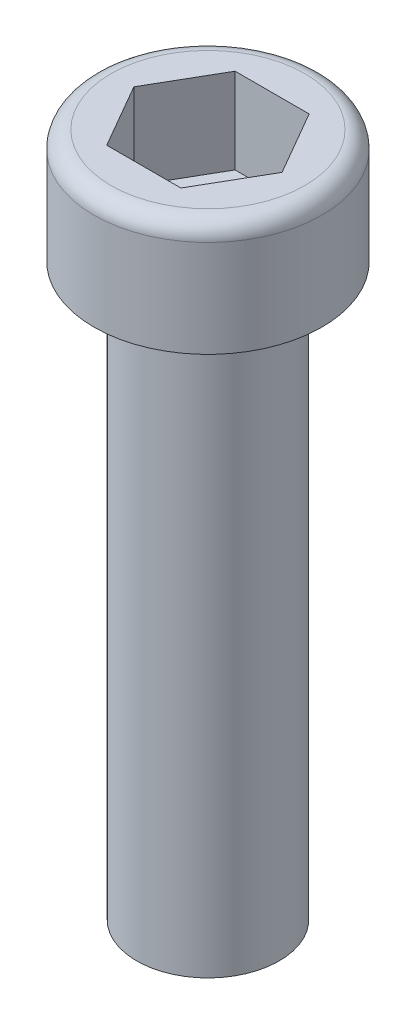
ISO-10303-21;
HEADER;
FILE_DESCRIPTION(('STEP AP214'),'2;1');
FILE_NAME('part.step','',(''),(''),'','','');
FILE_SCHEMA(('AUTOMOTIVE_DESIGN { 1 0 10303 214 1 1 1 1 }'));
ENDSEC;
DATA;
#1=APPLICATION_CONTEXT('core data for automotive mechanical design processes');
#2=APPLICATION_PROTOCOL_DEFINITION('international standard','automotive_design',2000,#1);
#3=PRODUCT_CONTEXT('',#1,'mechanical');
#4=PRODUCT('Part','Part','',(#3));
#5=PRODUCT_RELATED_PRODUCT_CATEGORY('part','',(#4));
#6=PRODUCT_DEFINITION_FORMATION('','',#4);
#7=PRODUCT_DEFINITION_CONTEXT('part definition',#1,'design');
#8=PRODUCT_DEFINITION('design','',#6,#7);
#9=PRODUCT_DEFINITION_SHAPE('','',#8);
#10=(LENGTH_UNIT() NAMED_UNIT(*) SI_UNIT(.MILLI.,.METRE.));
#11=(NAMED_UNIT(*) PLANE_ANGLE_UNIT() SI_UNIT($,.RADIAN.));
#12=(NAMED_UNIT(*) SI_UNIT($,.STERADIAN.) SOLID_ANGLE_UNIT());
#13=UNCERTAINTY_MEASURE_WITH_UNIT(LENGTH_MEASURE(1.E-05),#10,'distance_accuracy_value','');
#14=(GEOMETRIC_REPRESENTATION_CONTEXT(3) GLOBAL_UNCERTAINTY_ASSIGNED_CONTEXT((#13)) GLOBAL_UNIT_ASSIGNED_CONTEXT((#10,
#11,#12)) REPRESENTATION_CONTEXT('',''));
#15=CARTESIAN_POINT('',(0.,0.,0.));
#16=DIRECTION('',(0.,0.,1.));
#17=DIRECTION('',(1.,0.,0.));
#18=AXIS2_PLACEMENT_3D('',#15,#16,#17);
#19=CARTESIAN_POINT('',(0.,2.,0.));
#20=DIRECTION('',(0.,-1.,0.));
#21=DIRECTION('',(0.,0.,-1.));
#22=AXIS2_PLACEMENT_3D('',#19,#20,#21);
#23=CYLINDRICAL_SURFACE('',#22,2.);
#24=CARTESIAN_POINT('',(0.,1.7,0.));
#25=DIRECTION('',(0.,1.,0.));
#26=DIRECTION('',(0.,0.,1.));
#27=AXIS2_PLACEMENT_3D('',#24,#25,#26);
#28=CIRCLE('',#27,2.);
#29=CARTESIAN_POINT('',(0.,1.7,2.));
#30=VERTEX_POINT('',#29);
#31=EDGE_CURVE('E11',#30,#30,#28,.F.);
#32=ORIENTED_EDGE('',*,*,#31,.T.);
#33=EDGE_LOOP('',(#32));
#34=FACE_BOUND('',#33,.T.);
#35=CARTESIAN_POINT('',(0.,0.,0.));
#36=DIRECTION('',(0.,1.,0.));
#37=DIRECTION('',(0.,0.,1.));
#38=AXIS2_PLACEMENT_3D('',#35,#36,#37);
#39=CIRCLE('',#38,2.);
#40=CARTESIAN_POINT('',(0.,0.,2.));
#41=VERTEX_POINT('',#40);
#42=EDGE_CURVE('E169',#41,#41,#39,.T.);
#43=ORIENTED_EDGE('',*,*,#42,.T.);
#44=EDGE_LOOP('',(#43));
#45=FACE_BOUND('',#44,.T.);
#46=ADVANCED_FACE('F41',(#34,#45),#23,.T.);
#47=CARTESIAN_POINT('',(0.,2.,0.));
#48=DIRECTION('',(0.,1.,0.));
#49=DIRECTION('',(0.,0.,1.));
#50=AXIS2_PLACEMENT_3D('',#47,#48,#49);
#51=PLANE('',#50);
#52=DIRECTION('',(0.5,0.,-0.866025403784439));
#53=VECTOR('',#52,1.);
#54=CARTESIAN_POINT('',(0.649519052838329,2.,1.125));
#55=LINE('',#54,#53);
#56=CARTESIAN_POINT('',(0.649519052838329,2.,1.125));
#57=VERTEX_POINT('',#56);
#58=CARTESIAN_POINT('',(1.29903810567666,2.,0.));
#59=VERTEX_POINT('',#58);
#60=EDGE_CURVE('E57',#57,#59,#55,.T.);
#61=ORIENTED_EDGE('',*,*,#60,.F.);
#62=DIRECTION('',(1.,0.,0.));
#63=VECTOR('',#62,1.);
#64=CARTESIAN_POINT('',(-0.649519052838329,2.,1.125));
#65=LINE('',#64,#63);
#66=CARTESIAN_POINT('',(-0.649519052838329,2.,1.125));
#67=VERTEX_POINT('',#66);
#68=EDGE_CURVE('E150',#67,#57,#65,.T.);
#69=ORIENTED_EDGE('',*,*,#68,.F.);
#70=DIRECTION('',(0.5,0.,0.866025403784439));
#71=VECTOR('',#70,1.);
#72=CARTESIAN_POINT('',(-1.29903810567666,2.,0.));
#73=LINE('',#72,#71);
#74=CARTESIAN_POINT('',(-1.29903810567666,2.,0.));
#75=VERTEX_POINT('',#74);
#76=EDGE_CURVE('E147',#75,#67,#73,.T.);
#77=ORIENTED_EDGE('',*,*,#76,.F.);
#78=DIRECTION('',(-0.5,0.,0.866025403784439));
#79=VECTOR('',#78,1.);
#80=CARTESIAN_POINT('',(-0.649519052838329,2.,-1.125));
#81=LINE('',#80,#79);
#82=CARTESIAN_POINT('',(-0.649519052838329,2.,-1.125));
#83=VERTEX_POINT('',#82);
#84=EDGE_CURVE('E105',#83,#75,#81,.T.);
#85=ORIENTED_EDGE('',*,*,#84,.F.);
#86=DIRECTION('',(-1.,0.,0.));
#87=VECTOR('',#86,1.);
#88=CARTESIAN_POINT('',(0.649519052838328,2.,-1.125));
#89=LINE('',#88,#87);
#90=CARTESIAN_POINT('',(0.649519052838328,2.,-1.125));
#91=VERTEX_POINT('',#90);
#92=EDGE_CURVE('E141',#91,#83,#89,.T.);
#93=ORIENTED_EDGE('',*,*,#92,.F.);
#94=DIRECTION('',(-0.5,0.,-0.866025403784439));
#95=VECTOR('',#94,1.);
#96=CARTESIAN_POINT('',(1.29903810567666,2.,0.));
#97=LINE('',#96,#95);
#98=EDGE_CURVE('E137',#59,#91,#97,.T.);
#99=ORIENTED_EDGE('',*,*,#98,.F.);
#100=EDGE_LOOP('',(#61,#69,#77,#85,#93,#99));
#101=FACE_BOUND('',#100,.T.);
#102=CARTESIAN_POINT('',(0.,2.,0.));
#103=DIRECTION('',(0.,1.,0.));
#104=DIRECTION('',(0.,0.,1.));
#105=AXIS2_PLACEMENT_3D('',#102,#103,#104);
#106=CIRCLE('',#105,1.7);
#107=CARTESIAN_POINT('',(0.,2.,1.7));
#108=VERTEX_POINT('',#107);
#109=EDGE_CURVE('E50',#108,#108,#106,.T.);
#110=ORIENTED_EDGE('',*,*,#109,.T.);
#111=EDGE_LOOP('',(#110));
#112=FACE_BOUND('',#111,.T.);
#113=ADVANCED_FACE('F180',(#101,#112),#51,.T.);
#114=CARTESIAN_POINT('',(0.,0.,0.));
#115=DIRECTION('',(0.,1.,0.));
#116=DIRECTION('',(0.,0.,1.));
#117=AXIS2_PLACEMENT_3D('',#114,#115,#116);
#118=PLANE('',#117);
#119=CARTESIAN_POINT('',(0.,0.,0.));
#120=DIRECTION('',(0.,-1.,0.));
#121=DIRECTION('',(0.,0.,-1.));
#122=AXIS2_PLACEMENT_3D('',#119,#120,#121);
#123=CIRCLE('',#122,1.25);
#124=CARTESIAN_POINT('',(0.,0.,-1.25));
#125=VERTEX_POINT('',#124);
#126=EDGE_CURVE('E170',#125,#125,#123,.T.);
#127=ORIENTED_EDGE('',*,*,#126,.F.);
#128=EDGE_LOOP('',(#127));
#129=FACE_BOUND('',#128,.T.);
#130=ORIENTED_EDGE('',*,*,#42,.F.);
#131=EDGE_LOOP('',(#130));
#132=FACE_BOUND('',#131,.T.);
#133=ADVANCED_FACE('F201',(#129,#132),#118,.F.);
#134=CARTESIAN_POINT('',(0.,-10.,0.));
#135=DIRECTION('',(0.,1.,0.));
#136=DIRECTION('',(0.,0.,1.));
#137=AXIS2_PLACEMENT_3D('',#134,#135,#136);
#138=CYLINDRICAL_SURFACE('',#137,1.25);
#139=CARTESIAN_POINT('',(0.,-10.,0.));
#140=DIRECTION('',(0.,-1.,0.));
#141=DIRECTION('',(0.,0.,-1.));
#142=AXIS2_PLACEMENT_3D('',#139,#140,#141);
#143=CIRCLE('',#142,1.25);
#144=CARTESIAN_POINT('',(0.,-10.,-1.25));
#145=VERTEX_POINT('',#144);
#146=EDGE_CURVE('E156',#145,#145,#143,.T.);
#147=ORIENTED_EDGE('',*,*,#146,.F.);
#148=EDGE_LOOP('',(#147));
#149=FACE_BOUND('',#148,.T.);
#150=ORIENTED_EDGE('',*,*,#126,.T.);
#151=EDGE_LOOP('',(#150));
#152=FACE_BOUND('',#151,.T.);
#153=ADVANCED_FACE('F192',(#149,#152),#138,.T.);
#154=CARTESIAN_POINT('',(0.,-10.,0.));
#155=DIRECTION('',(0.,-1.,0.));
#156=DIRECTION('',(0.,0.,-1.));
#157=AXIS2_PLACEMENT_3D('',#154,#155,#156);
#158=PLANE('',#157);
#159=ORIENTED_EDGE('',*,*,#146,.T.);
#160=EDGE_LOOP('',(#159));
#161=FACE_BOUND('',#160,.T.);
#162=ADVANCED_FACE('F184',(#161),#158,.T.);
#163=CARTESIAN_POINT('',(0.,1.7,0.));
#164=DIRECTION('',(0.,1.,0.));
#165=DIRECTION('',(0.,0.,1.));
#166=AXIS2_PLACEMENT_3D('',#163,#164,#165);
#167=TOROIDAL_SURFACE('',#166,1.7,0.3);
#168=ORIENTED_EDGE('',*,*,#31,.F.);
#169=EDGE_LOOP('',(#168));
#170=FACE_BOUND('',#169,.T.);
#171=ORIENTED_EDGE('',*,*,#109,.F.);
#172=EDGE_LOOP('',(#171));
#173=FACE_BOUND('',#172,.T.);
#174=ADVANCED_FACE('F43',(#170,#173),#167,.T.);
#175=CARTESIAN_POINT('',(0.649519052838329,0.5,1.125));
#176=DIRECTION('',(0.866025403784439,0.,0.5));
#177=DIRECTION('',(0.5,0.,-0.866025403784439));
#178=AXIS2_PLACEMENT_3D('',#175,#176,#177);
#179=PLANE('',#178);
#180=ORIENTED_EDGE('',*,*,#60,.T.);
#181=DIRECTION('',(0.,1.,0.));
#182=VECTOR('',#181,1.);
#183=CARTESIAN_POINT('',(1.29903810567666,0.5,0.));
#184=LINE('',#183,#182);
#185=CARTESIAN_POINT('',(1.29903810567666,0.5,0.));
#186=VERTEX_POINT('',#185);
#187=EDGE_CURVE('E87',#186,#59,#184,.T.);
#188=ORIENTED_EDGE('',*,*,#187,.F.);
#189=DIRECTION('',(0.5,0.,-0.866025403784439));
#190=VECTOR('',#189,1.);
#191=CARTESIAN_POINT('',(0.649519052838329,0.5,1.125));
#192=LINE('',#191,#190);
#193=CARTESIAN_POINT('',(0.649519052838329,0.5,1.125));
#194=VERTEX_POINT('',#193);
#195=EDGE_CURVE('E153',#194,#186,#192,.T.);
#196=ORIENTED_EDGE('',*,*,#195,.F.);
#197=DIRECTION('',(0.,1.,0.));
#198=VECTOR('',#197,1.);
#199=CARTESIAN_POINT('',(0.649519052838329,0.5,1.125));
#200=LINE('',#199,#198);
#201=EDGE_CURVE('E65',#194,#57,#200,.T.);
#202=ORIENTED_EDGE('',*,*,#201,.T.);
#203=EDGE_LOOP('',(#180,#188,#196,#202));
#204=FACE_BOUND('',#203,.T.);
#205=ADVANCED_FACE('F183',(#204),#179,.F.);
#206=CARTESIAN_POINT('',(-0.649519052838329,0.5,1.125));
#207=DIRECTION('',(0.,0.,1.));
#208=DIRECTION('',(1.,0.,0.));
#209=AXIS2_PLACEMENT_3D('',#206,#207,#208);
#210=PLANE('',#209);
#211=ORIENTED_EDGE('',*,*,#68,.T.);
#212=ORIENTED_EDGE('',*,*,#201,.F.);
#213=DIRECTION('',(1.,0.,0.));
#214=VECTOR('',#213,1.);
#215=CARTESIAN_POINT('',(-0.649519052838329,0.5,1.125));
#216=LINE('',#215,#214);
#217=CARTESIAN_POINT('',(-0.649519052838329,0.5,1.125));
#218=VERTEX_POINT('',#217);
#219=EDGE_CURVE('E119',#218,#194,#216,.T.);
#220=ORIENTED_EDGE('',*,*,#219,.F.);
#221=DIRECTION('',(0.,1.,0.));
#222=VECTOR('',#221,1.);
#223=CARTESIAN_POINT('',(-0.649519052838329,0.5,1.125));
#224=LINE('',#223,#222);
#225=EDGE_CURVE('E110',#218,#67,#224,.T.);
#226=ORIENTED_EDGE('',*,*,#225,.T.);
#227=EDGE_LOOP('',(#211,#212,#220,#226));
#228=FACE_BOUND('',#227,.T.);
#229=ADVANCED_FACE('F190',(#228),#210,.F.);
#230=CARTESIAN_POINT('',(-1.29903810567666,0.5,0.));
#231=DIRECTION('',(-0.866025403784439,0.,0.5));
#232=DIRECTION('',(0.5,0.,0.866025403784439));
#233=AXIS2_PLACEMENT_3D('',#230,#231,#232);
#234=PLANE('',#233);
#235=ORIENTED_EDGE('',*,*,#76,.T.);
#236=ORIENTED_EDGE('',*,*,#225,.F.);
#237=DIRECTION('',(0.5,0.,0.866025403784439));
#238=VECTOR('',#237,1.);
#239=CARTESIAN_POINT('',(-1.29903810567666,0.5,0.));
#240=LINE('',#239,#238);
#241=CARTESIAN_POINT('',(-1.29903810567666,0.5,0.));
#242=VERTEX_POINT('',#241);
#243=EDGE_CURVE('E114',#242,#218,#240,.T.);
#244=ORIENTED_EDGE('',*,*,#243,.F.);
#245=DIRECTION('',(0.,1.,0.));
#246=VECTOR('',#245,1.);
#247=CARTESIAN_POINT('',(-1.29903810567666,0.5,0.));
#248=LINE('',#247,#246);
#249=EDGE_CURVE('E98',#242,#75,#248,.T.);
#250=ORIENTED_EDGE('',*,*,#249,.T.);
#251=EDGE_LOOP('',(#235,#236,#244,#250));
#252=FACE_BOUND('',#251,.T.);
#253=ADVANCED_FACE('F115',(#252),#234,.F.);
#254=CARTESIAN_POINT('',(-0.649519052838329,0.5,-1.125));
#255=DIRECTION('',(-0.866025403784439,0.,-0.5));
#256=DIRECTION('',(-0.5,0.,0.866025403784439));
#257=AXIS2_PLACEMENT_3D('',#254,#255,#256);
#258=PLANE('',#257);
#259=ORIENTED_EDGE('',*,*,#84,.T.);
#260=ORIENTED_EDGE('',*,*,#249,.F.);
#261=DIRECTION('',(-0.5,0.,0.866025403784439));
#262=VECTOR('',#261,1.);
#263=CARTESIAN_POINT('',(-0.649519052838329,0.5,-1.125));
#264=LINE('',#263,#262);
#265=CARTESIAN_POINT('',(-0.649519052838329,0.5,-1.125));
#266=VERTEX_POINT('',#265);
#267=EDGE_CURVE('E102',#266,#242,#264,.T.);
#268=ORIENTED_EDGE('',*,*,#267,.F.);
#269=DIRECTION('',(0.,1.,0.));
#270=VECTOR('',#269,1.);
#271=CARTESIAN_POINT('',(-0.649519052838329,0.5,-1.125));
#272=LINE('',#271,#270);
#273=EDGE_CURVE('E111',#266,#83,#272,.T.);
#274=ORIENTED_EDGE('',*,*,#273,.T.);
#275=EDGE_LOOP('',(#259,#260,#268,#274));
#276=FACE_BOUND('',#275,.T.);
#277=ADVANCED_FACE('F100',(#276),#258,.F.);
#278=CARTESIAN_POINT('',(0.649519052838328,0.5,-1.125));
#279=DIRECTION('',(0.,0.,-1.));
#280=DIRECTION('',(-1.,0.,0.));
#281=AXIS2_PLACEMENT_3D('',#278,#279,#280);
#282=PLANE('',#281);
#283=ORIENTED_EDGE('',*,*,#92,.T.);
#284=ORIENTED_EDGE('',*,*,#273,.F.);
#285=DIRECTION('',(-1.,0.,0.));
#286=VECTOR('',#285,1.);
#287=CARTESIAN_POINT('',(0.649519052838328,0.5,-1.125));
#288=LINE('',#287,#286);
#289=CARTESIAN_POINT('',(0.649519052838328,0.5,-1.125));
#290=VERTEX_POINT('',#289);
#291=EDGE_CURVE('E125',#290,#266,#288,.T.);
#292=ORIENTED_EDGE('',*,*,#291,.F.);
#293=DIRECTION('',(0.,1.,0.));
#294=VECTOR('',#293,1.);
#295=CARTESIAN_POINT('',(0.649519052838328,0.5,-1.125));
#296=LINE('',#295,#294);
#297=EDGE_CURVE('E161',#290,#91,#296,.T.);
#298=ORIENTED_EDGE('',*,*,#297,.T.);
#299=EDGE_LOOP('',(#283,#284,#292,#298));
#300=FACE_BOUND('',#299,.T.);
#301=ADVANCED_FACE('F215',(#300),#282,.F.);
#302=CARTESIAN_POINT('',(1.29903810567666,0.5,0.));
#303=DIRECTION('',(0.866025403784438,0.,-0.5));
#304=DIRECTION('',(-0.5,0.,-0.866025403784439));
#305=AXIS2_PLACEMENT_3D('',#302,#303,#304);
#306=PLANE('',#305);
#307=ORIENTED_EDGE('',*,*,#98,.T.);
#308=ORIENTED_EDGE('',*,*,#297,.F.);
#309=DIRECTION('',(-0.5,0.,-0.866025403784439));
#310=VECTOR('',#309,1.);
#311=CARTESIAN_POINT('',(1.29903810567666,0.5,0.));
#312=LINE('',#311,#310);
#313=EDGE_CURVE('E129',#186,#290,#312,.T.);
#314=ORIENTED_EDGE('',*,*,#313,.F.);
#315=ORIENTED_EDGE('',*,*,#187,.T.);
#316=EDGE_LOOP('',(#307,#308,#314,#315));
#317=FACE_BOUND('',#316,.T.);
#318=ADVANCED_FACE('F212',(#317),#306,.F.);
#319=CARTESIAN_POINT('',(0.,0.5,0.));
#320=DIRECTION('',(0.,1.,0.));
#321=DIRECTION('',(0.,0.,1.));
#322=AXIS2_PLACEMENT_3D('',#319,#320,#321);
#323=PLANE('',#322);
#324=ORIENTED_EDGE('',*,*,#195,.T.);
#325=ORIENTED_EDGE('',*,*,#313,.T.);
#326=ORIENTED_EDGE('',*,*,#291,.T.);
#327=ORIENTED_EDGE('',*,*,#267,.T.);
#328=ORIENTED_EDGE('',*,*,#243,.T.);
#329=ORIENTED_EDGE('',*,*,#219,.T.);
#330=EDGE_LOOP('',(#324,#325,#326,#327,#328,#329));
#331=FACE_BOUND('',#330,.T.);
#332=ADVANCED_FACE('F122',(#331),#323,.T.);
#333=CLOSED_SHELL('',(#46,#113,#133,#153,#162,#174,#205,#229,#253,#277,#301,#318,#332));
#334=MANIFOLD_SOLID_BREP('B2',#333);
#335=ADVANCED_BREP_SHAPE_REPRESENTATION('',(#18,#334),#14);
#336=SHAPE_DEFINITION_REPRESENTATION(#9,#335);
ENDSEC;
END-ISO-10303-21;
